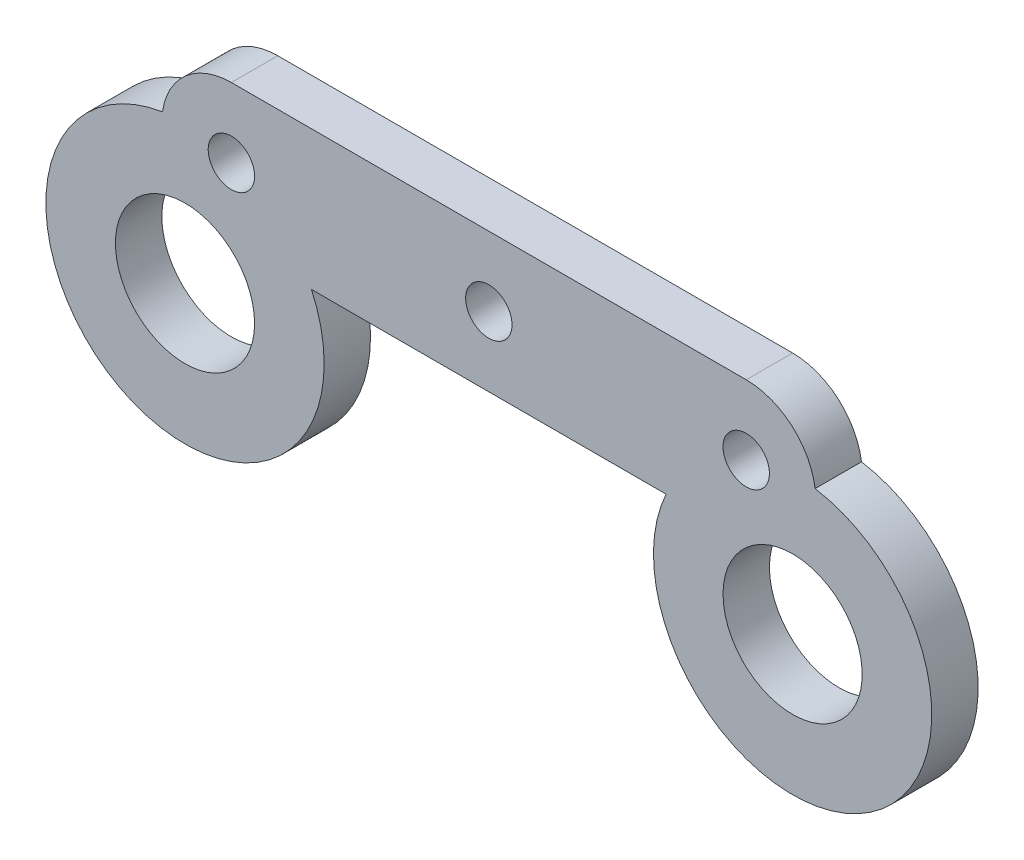
ISO-10303-21;
HEADER;
FILE_DESCRIPTION(('STEP AP214'),'2;1');
FILE_NAME('part.step','',(''),(''),'','','');
FILE_SCHEMA(('AUTOMOTIVE_DESIGN { 1 0 10303 214 1 1 1 1 }'));
ENDSEC;
DATA;
#1=APPLICATION_CONTEXT('core data for automotive mechanical design processes');
#2=APPLICATION_PROTOCOL_DEFINITION('international standard','automotive_design',2000,#1);
#3=PRODUCT_CONTEXT('',#1,'mechanical');
#4=PRODUCT('Part','Part','',(#3));
#5=PRODUCT_RELATED_PRODUCT_CATEGORY('part','',(#4));
#6=PRODUCT_DEFINITION_FORMATION('','',#4);
#7=PRODUCT_DEFINITION_CONTEXT('part definition',#1,'design');
#8=PRODUCT_DEFINITION('design','',#6,#7);
#9=PRODUCT_DEFINITION_SHAPE('','',#8);
#10=(LENGTH_UNIT() NAMED_UNIT(*) SI_UNIT(.MILLI.,.METRE.));
#11=(NAMED_UNIT(*) PLANE_ANGLE_UNIT() SI_UNIT($,.RADIAN.));
#12=(NAMED_UNIT(*) SI_UNIT($,.STERADIAN.) SOLID_ANGLE_UNIT());
#13=UNCERTAINTY_MEASURE_WITH_UNIT(LENGTH_MEASURE(1.E-05),#10,'distance_accuracy_value','');
#14=(GEOMETRIC_REPRESENTATION_CONTEXT(3) GLOBAL_UNCERTAINTY_ASSIGNED_CONTEXT((#13)) GLOBAL_UNIT_ASSIGNED_CONTEXT((#10,
#11,#12)) REPRESENTATION_CONTEXT('',''));
#15=CARTESIAN_POINT('',(0.,0.,0.));
#16=DIRECTION('',(0.,0.,1.));
#17=DIRECTION('',(1.,0.,0.));
#18=AXIS2_PLACEMENT_3D('',#15,#16,#17);
#19=CARTESIAN_POINT('',(11.1001903742504,0.,2.));
#20=DIRECTION('',(0.,0.,1.));
#21=DIRECTION('',(1.,0.,0.));
#22=AXIS2_PLACEMENT_3D('',#19,#20,#21);
#23=PLANE('',#22);
#24=CARTESIAN_POINT('',(-11.1001903742504,0.,2.));
#25=DIRECTION('',(0.,0.,1.));
#26=DIRECTION('',(1.,0.,0.));
#27=AXIS2_PLACEMENT_3D('',#24,#25,#26);
#28=CIRCLE('',#27,0.99999999999969);
#29=CARTESIAN_POINT('',(-10.1001903742507,0.,2.));
#30=VERTEX_POINT('',#29);
#31=EDGE_CURVE('E206',#30,#30,#28,.T.);
#32=ORIENTED_EDGE('',*,*,#31,.F.);
#33=EDGE_LOOP('',(#32));
#34=FACE_BOUND('',#33,.T.);
#35=CARTESIAN_POINT('',(13.1001903742511,-5.49999999999931,2.));
#36=DIRECTION('',(0.,0.,1.));
#37=DIRECTION('',(-1.,0.,0.));
#38=AXIS2_PLACEMENT_3D('',#35,#36,#37);
#39=CIRCLE('',#38,3.);
#40=CARTESIAN_POINT('',(10.1001903742511,-5.49999999999931,2.));
#41=VERTEX_POINT('',#40);
#42=EDGE_CURVE('E218',#41,#41,#39,.T.);
#43=ORIENTED_EDGE('',*,*,#42,.F.);
#44=EDGE_LOOP('',(#43));
#45=FACE_BOUND('',#44,.T.);
#46=CARTESIAN_POINT('',(11.1001903742504,0.,2.));
#47=DIRECTION('',(0.,0.,1.));
#48=DIRECTION('',(1.,0.,0.));
#49=AXIS2_PLACEMENT_3D('',#46,#47,#48);
#50=CIRCLE('',#49,3.);
#51=CARTESIAN_POINT('',(14.0705002353822,0.421021767683334,2.));
#52=VERTEX_POINT('',#51);
#53=CARTESIAN_POINT('',(11.1001903742504,3.,2.));
#54=VERTEX_POINT('',#53);
#55=EDGE_CURVE('E129',#52,#54,#50,.T.);
#56=ORIENTED_EDGE('',*,*,#55,.T.);
#57=DIRECTION('',(-1.,0.,0.));
#58=VECTOR('',#57,1.);
#59=CARTESIAN_POINT('',(-11.1001903742504,3.,2.));
#60=LINE('',#59,#58);
#61=CARTESIAN_POINT('',(-11.1001903742504,3.,2.));
#62=VERTEX_POINT('',#61);
#63=EDGE_CURVE('E87',#54,#62,#60,.T.);
#64=ORIENTED_EDGE('',*,*,#63,.T.);
#65=CARTESIAN_POINT('',(-11.1001903742504,0.,2.));
#66=DIRECTION('',(0.,0.,1.));
#67=DIRECTION('',(1.,0.,0.));
#68=AXIS2_PLACEMENT_3D('',#65,#66,#67);
#69=CIRCLE('',#68,3.);
#70=CARTESIAN_POINT('',(-14.0705002353822,0.421021767683246,2.));
#71=VERTEX_POINT('',#70);
#72=EDGE_CURVE('E100',#62,#71,#69,.T.);
#73=ORIENTED_EDGE('',*,*,#72,.T.);
#74=CARTESIAN_POINT('',(-13.100190374251,-5.49999999999942,2.));
#75=DIRECTION('',(0.,0.,1.));
#76=DIRECTION('',(1.,0.,0.));
#77=AXIS2_PLACEMENT_3D('',#74,#75,#76);
#78=CIRCLE('',#77,5.99999999999837);
#79=CARTESIAN_POINT('',(-7.64583431693467,-3.,2.));
#80=VERTEX_POINT('',#79);
#81=EDGE_CURVE('E94',#71,#80,#78,.T.);
#82=ORIENTED_EDGE('',*,*,#81,.T.);
#83=DIRECTION('',(1.,0.,0.));
#84=VECTOR('',#83,1.);
#85=CARTESIAN_POINT('',(-7.64583431693467,-3.,2.));
#86=LINE('',#85,#84);
#87=CARTESIAN_POINT('',(7.64583431693468,-3.,2.));
#88=VERTEX_POINT('',#87);
#89=EDGE_CURVE('E98',#80,#88,#86,.T.);
#90=ORIENTED_EDGE('',*,*,#89,.T.);
#91=CARTESIAN_POINT('',(13.1001903742511,-5.49999999999931,2.));
#92=DIRECTION('',(0.,0.,1.));
#93=DIRECTION('',(1.,0.,0.));
#94=AXIS2_PLACEMENT_3D('',#91,#92,#93);
#95=CIRCLE('',#94,5.99999999999833);
#96=EDGE_CURVE('E50',#88,#52,#95,.T.);
#97=ORIENTED_EDGE('',*,*,#96,.T.);
#98=EDGE_LOOP('',(#56,#64,#73,#82,#90,#97));
#99=FACE_BOUND('',#98,.T.);
#100=CARTESIAN_POINT('',(0.,0.,2.));
#101=DIRECTION('',(0.,0.,1.));
#102=DIRECTION('',(1.,0.,0.));
#103=AXIS2_PLACEMENT_3D('',#100,#101,#102);
#104=CIRCLE('',#103,1.);
#105=CARTESIAN_POINT('',(1.,0.,2.));
#106=VERTEX_POINT('',#105);
#107=EDGE_CURVE('E122',#106,#106,#104,.T.);
#108=ORIENTED_EDGE('',*,*,#107,.F.);
#109=EDGE_LOOP('',(#108));
#110=FACE_BOUND('',#109,.T.);
#111=CARTESIAN_POINT('',(-13.100190374251,-5.49999999999942,2.));
#112=DIRECTION('',(0.,0.,1.));
#113=DIRECTION('',(1.,0.,0.));
#114=AXIS2_PLACEMENT_3D('',#111,#112,#113);
#115=CIRCLE('',#114,3.);
#116=CARTESIAN_POINT('',(-10.100190374251,-5.49999999999942,2.));
#117=VERTEX_POINT('',#116);
#118=EDGE_CURVE('E212',#117,#117,#115,.T.);
#119=ORIENTED_EDGE('',*,*,#118,.F.);
#120=EDGE_LOOP('',(#119));
#121=FACE_BOUND('',#120,.T.);
#122=CARTESIAN_POINT('',(11.1001903742504,0.,2.));
#123=DIRECTION('',(0.,0.,1.));
#124=DIRECTION('',(-1.,0.,0.));
#125=AXIS2_PLACEMENT_3D('',#122,#123,#124);
#126=CIRCLE('',#125,1.00000000000028);
#127=CARTESIAN_POINT('',(10.1001903742501,0.,2.));
#128=VERTEX_POINT('',#127);
#129=EDGE_CURVE('E198',#128,#128,#126,.T.);
#130=ORIENTED_EDGE('',*,*,#129,.F.);
#131=EDGE_LOOP('',(#130));
#132=FACE_BOUND('',#131,.T.);
#133=ADVANCED_FACE('F33',(#34,#45,#99,#110,#121,#132),#23,.T.);
#134=CARTESIAN_POINT('',(11.1001903742504,0.,0.));
#135=DIRECTION('',(0.,0.,1.));
#136=DIRECTION('',(1.,0.,0.));
#137=AXIS2_PLACEMENT_3D('',#134,#135,#136);
#138=PLANE('',#137);
#139=CARTESIAN_POINT('',(-11.1001903742504,0.,0.));
#140=DIRECTION('',(0.,0.,1.));
#141=DIRECTION('',(1.,0.,0.));
#142=AXIS2_PLACEMENT_3D('',#139,#140,#141);
#143=CIRCLE('',#142,0.99999999999969);
#144=CARTESIAN_POINT('',(-10.1001903742507,0.,0.));
#145=VERTEX_POINT('',#144);
#146=EDGE_CURVE('E204',#145,#145,#143,.T.);
#147=ORIENTED_EDGE('',*,*,#146,.T.);
#148=EDGE_LOOP('',(#147));
#149=FACE_BOUND('',#148,.T.);
#150=CARTESIAN_POINT('',(13.1001903742511,-5.49999999999931,0.));
#151=DIRECTION('',(0.,0.,1.));
#152=DIRECTION('',(-1.,0.,0.));
#153=AXIS2_PLACEMENT_3D('',#150,#151,#152);
#154=CIRCLE('',#153,3.);
#155=CARTESIAN_POINT('',(10.1001903742511,-5.49999999999931,0.));
#156=VERTEX_POINT('',#155);
#157=EDGE_CURVE('E215',#156,#156,#154,.T.);
#158=ORIENTED_EDGE('',*,*,#157,.T.);
#159=EDGE_LOOP('',(#158));
#160=FACE_BOUND('',#159,.T.);
#161=CARTESIAN_POINT('',(11.1001903742504,0.,0.));
#162=DIRECTION('',(0.,0.,1.));
#163=DIRECTION('',(1.,0.,0.));
#164=AXIS2_PLACEMENT_3D('',#161,#162,#163);
#165=CIRCLE('',#164,3.);
#166=CARTESIAN_POINT('',(14.0705002353822,0.421021767683334,0.));
#167=VERTEX_POINT('',#166);
#168=CARTESIAN_POINT('',(11.1001903742504,3.,0.));
#169=VERTEX_POINT('',#168);
#170=EDGE_CURVE('E118',#167,#169,#165,.T.);
#171=ORIENTED_EDGE('',*,*,#170,.F.);
#172=CARTESIAN_POINT('',(13.1001903742511,-5.49999999999931,0.));
#173=DIRECTION('',(0.,0.,1.));
#174=DIRECTION('',(1.,0.,0.));
#175=AXIS2_PLACEMENT_3D('',#172,#173,#174);
#176=CIRCLE('',#175,5.99999999999833);
#177=CARTESIAN_POINT('',(7.64583431693468,-3.,0.));
#178=VERTEX_POINT('',#177);
#179=EDGE_CURVE('E79',#178,#167,#176,.T.);
#180=ORIENTED_EDGE('',*,*,#179,.F.);
#181=DIRECTION('',(1.,0.,0.));
#182=VECTOR('',#181,1.);
#183=CARTESIAN_POINT('',(-7.64583431693467,-3.,0.));
#184=LINE('',#183,#182);
#185=CARTESIAN_POINT('',(-7.64583431693467,-3.,0.));
#186=VERTEX_POINT('',#185);
#187=EDGE_CURVE('E73',#186,#178,#184,.T.);
#188=ORIENTED_EDGE('',*,*,#187,.F.);
#189=CARTESIAN_POINT('',(-13.100190374251,-5.49999999999942,0.));
#190=DIRECTION('',(0.,0.,1.));
#191=DIRECTION('',(1.,0.,0.));
#192=AXIS2_PLACEMENT_3D('',#189,#190,#191);
#193=CIRCLE('',#192,5.99999999999837);
#194=CARTESIAN_POINT('',(-14.0705002353822,0.421021767683246,0.));
#195=VERTEX_POINT('',#194);
#196=EDGE_CURVE('E108',#195,#186,#193,.T.);
#197=ORIENTED_EDGE('',*,*,#196,.F.);
#198=CARTESIAN_POINT('',(-11.1001903742504,0.,0.));
#199=DIRECTION('',(0.,0.,1.));
#200=DIRECTION('',(1.,0.,0.));
#201=AXIS2_PLACEMENT_3D('',#198,#199,#200);
#202=CIRCLE('',#201,3.);
#203=CARTESIAN_POINT('',(-11.1001903742504,3.,0.));
#204=VERTEX_POINT('',#203);
#205=EDGE_CURVE('E124',#204,#195,#202,.T.);
#206=ORIENTED_EDGE('',*,*,#205,.F.);
#207=DIRECTION('',(-1.,0.,0.));
#208=VECTOR('',#207,1.);
#209=CARTESIAN_POINT('',(-11.1001903742504,3.,0.));
#210=LINE('',#209,#208);
#211=EDGE_CURVE('E121',#169,#204,#210,.T.);
#212=ORIENTED_EDGE('',*,*,#211,.F.);
#213=EDGE_LOOP('',(#171,#180,#188,#197,#206,#212));
#214=FACE_BOUND('',#213,.T.);
#215=CARTESIAN_POINT('',(0.,0.,0.));
#216=DIRECTION('',(0.,0.,1.));
#217=DIRECTION('',(1.,0.,0.));
#218=AXIS2_PLACEMENT_3D('',#215,#216,#217);
#219=CIRCLE('',#218,1.);
#220=CARTESIAN_POINT('',(1.,0.,0.));
#221=VERTEX_POINT('',#220);
#222=EDGE_CURVE('E221',#221,#221,#219,.T.);
#223=ORIENTED_EDGE('',*,*,#222,.T.);
#224=EDGE_LOOP('',(#223));
#225=FACE_BOUND('',#224,.T.);
#226=CARTESIAN_POINT('',(-13.100190374251,-5.49999999999942,0.));
#227=DIRECTION('',(0.,0.,1.));
#228=DIRECTION('',(1.,0.,0.));
#229=AXIS2_PLACEMENT_3D('',#226,#227,#228);
#230=CIRCLE('',#229,3.);
#231=CARTESIAN_POINT('',(-10.100190374251,-5.49999999999942,0.));
#232=VERTEX_POINT('',#231);
#233=EDGE_CURVE('E209',#232,#232,#230,.T.);
#234=ORIENTED_EDGE('',*,*,#233,.T.);
#235=EDGE_LOOP('',(#234));
#236=FACE_BOUND('',#235,.T.);
#237=CARTESIAN_POINT('',(11.1001903742504,0.,0.));
#238=DIRECTION('',(0.,0.,1.));
#239=DIRECTION('',(-1.,0.,0.));
#240=AXIS2_PLACEMENT_3D('',#237,#238,#239);
#241=CIRCLE('',#240,1.00000000000028);
#242=CARTESIAN_POINT('',(10.1001903742501,0.,0.));
#243=VERTEX_POINT('',#242);
#244=EDGE_CURVE('E194',#243,#243,#241,.T.);
#245=ORIENTED_EDGE('',*,*,#244,.T.);
#246=EDGE_LOOP('',(#245));
#247=FACE_BOUND('',#246,.T.);
#248=ADVANCED_FACE('F138',(#149,#160,#214,#225,#236,#247),#138,.F.);
#249=CARTESIAN_POINT('',(11.1001903742504,0.,2.));
#250=DIRECTION('',(0.,0.,-1.));
#251=DIRECTION('',(-1.,0.,0.));
#252=AXIS2_PLACEMENT_3D('',#249,#250,#251);
#253=CYLINDRICAL_SURFACE('',#252,3.);
#254=ORIENTED_EDGE('',*,*,#170,.T.);
#255=DIRECTION('',(0.,0.,-1.));
#256=VECTOR('',#255,1.);
#257=CARTESIAN_POINT('',(11.1001903742504,3.,2.));
#258=LINE('',#257,#256);
#259=EDGE_CURVE('E11',#54,#169,#258,.T.);
#260=ORIENTED_EDGE('',*,*,#259,.F.);
#261=ORIENTED_EDGE('',*,*,#55,.F.);
#262=DIRECTION('',(0.,0.,-1.));
#263=VECTOR('',#262,1.);
#264=CARTESIAN_POINT('',(14.0705002353822,0.421021767683334,2.));
#265=LINE('',#264,#263);
#266=EDGE_CURVE('E114',#52,#167,#265,.T.);
#267=ORIENTED_EDGE('',*,*,#266,.T.);
#268=EDGE_LOOP('',(#254,#260,#261,#267));
#269=FACE_BOUND('',#268,.T.);
#270=ADVANCED_FACE('F35',(#269),#253,.T.);
#271=CARTESIAN_POINT('',(-11.1001903742504,3.,2.));
#272=DIRECTION('',(0.,-1.,0.));
#273=DIRECTION('',(0.,0.,-1.));
#274=AXIS2_PLACEMENT_3D('',#271,#272,#273);
#275=PLANE('',#274);
#276=ORIENTED_EDGE('',*,*,#211,.T.);
#277=DIRECTION('',(0.,0.,-1.));
#278=VECTOR('',#277,1.);
#279=CARTESIAN_POINT('',(-11.1001903742504,3.,2.));
#280=LINE('',#279,#278);
#281=EDGE_CURVE('E42',#62,#204,#280,.T.);
#282=ORIENTED_EDGE('',*,*,#281,.F.);
#283=ORIENTED_EDGE('',*,*,#63,.F.);
#284=ORIENTED_EDGE('',*,*,#259,.T.);
#285=EDGE_LOOP('',(#276,#282,#283,#284));
#286=FACE_BOUND('',#285,.T.);
#287=ADVANCED_FACE('F297',(#286),#275,.F.);
#288=CARTESIAN_POINT('',(-11.1001903742504,0.,2.));
#289=DIRECTION('',(0.,0.,-1.));
#290=DIRECTION('',(-1.,0.,0.));
#291=AXIS2_PLACEMENT_3D('',#288,#289,#290);
#292=CYLINDRICAL_SURFACE('',#291,3.);
#293=ORIENTED_EDGE('',*,*,#205,.T.);
#294=DIRECTION('',(0.,0.,-1.));
#295=VECTOR('',#294,1.);
#296=CARTESIAN_POINT('',(-14.0705002353822,0.421021767683246,2.));
#297=LINE('',#296,#295);
#298=EDGE_CURVE('E109',#71,#195,#297,.T.);
#299=ORIENTED_EDGE('',*,*,#298,.F.);
#300=ORIENTED_EDGE('',*,*,#72,.F.);
#301=ORIENTED_EDGE('',*,*,#281,.T.);
#302=EDGE_LOOP('',(#293,#299,#300,#301));
#303=FACE_BOUND('',#302,.T.);
#304=ADVANCED_FACE('F135',(#303),#292,.T.);
#305=CARTESIAN_POINT('',(-13.100190374251,-5.49999999999942,2.));
#306=DIRECTION('',(0.,0.,-1.));
#307=DIRECTION('',(-1.,0.,0.));
#308=AXIS2_PLACEMENT_3D('',#305,#306,#307);
#309=CYLINDRICAL_SURFACE('',#308,5.99999999999837);
#310=ORIENTED_EDGE('',*,*,#196,.T.);
#311=DIRECTION('',(0.,0.,-1.));
#312=VECTOR('',#311,1.);
#313=CARTESIAN_POINT('',(-7.64583431693467,-3.,2.));
#314=LINE('',#313,#312);
#315=EDGE_CURVE('E105',#80,#186,#314,.T.);
#316=ORIENTED_EDGE('',*,*,#315,.F.);
#317=ORIENTED_EDGE('',*,*,#81,.F.);
#318=ORIENTED_EDGE('',*,*,#298,.T.);
#319=EDGE_LOOP('',(#310,#316,#317,#318));
#320=FACE_BOUND('',#319,.T.);
#321=ADVANCED_FACE('F106',(#320),#309,.T.);
#322=CARTESIAN_POINT('',(-7.64583431693467,-3.,2.));
#323=DIRECTION('',(0.,1.,0.));
#324=DIRECTION('',(0.,0.,1.));
#325=AXIS2_PLACEMENT_3D('',#322,#323,#324);
#326=PLANE('',#325);
#327=CARTESIAN_POINT('',(0.,-3.,1.));
#328=DIRECTION('',(0.,-1.,0.));
#329=DIRECTION('',(0.,0.,-1.));
#330=AXIS2_PLACEMENT_3D('',#327,#328,#329);
#331=CIRCLE('',#330,0.5);
#332=CARTESIAN_POINT('',(0.,-3.,0.5));
#333=VERTEX_POINT('',#332);
#334=EDGE_CURVE('E195',#333,#333,#331,.T.);
#335=ORIENTED_EDGE('',*,*,#334,.F.);
#336=EDGE_LOOP('',(#335));
#337=FACE_BOUND('',#336,.T.);
#338=ORIENTED_EDGE('',*,*,#187,.T.);
#339=DIRECTION('',(0.,0.,-1.));
#340=VECTOR('',#339,1.);
#341=CARTESIAN_POINT('',(7.64583431693468,-3.,2.));
#342=LINE('',#341,#340);
#343=EDGE_CURVE('E110',#88,#178,#342,.T.);
#344=ORIENTED_EDGE('',*,*,#343,.F.);
#345=ORIENTED_EDGE('',*,*,#89,.F.);
#346=ORIENTED_EDGE('',*,*,#315,.T.);
#347=EDGE_LOOP('',(#338,#344,#345,#346));
#348=FACE_BOUND('',#347,.T.);
#349=ADVANCED_FACE('F112',(#337,#348),#326,.F.);
#350=CARTESIAN_POINT('',(13.1001903742511,-5.49999999999931,2.));
#351=DIRECTION('',(0.,0.,-1.));
#352=DIRECTION('',(-1.,0.,0.));
#353=AXIS2_PLACEMENT_3D('',#350,#351,#352);
#354=CYLINDRICAL_SURFACE('',#353,5.99999999999833);
#355=ORIENTED_EDGE('',*,*,#179,.T.);
#356=ORIENTED_EDGE('',*,*,#266,.F.);
#357=ORIENTED_EDGE('',*,*,#96,.F.);
#358=ORIENTED_EDGE('',*,*,#343,.T.);
#359=EDGE_LOOP('',(#355,#356,#357,#358));
#360=FACE_BOUND('',#359,.T.);
#361=ADVANCED_FACE('F143',(#360),#354,.T.);
#362=CARTESIAN_POINT('',(0.,0.,2.));
#363=DIRECTION('',(0.,0.,-1.));
#364=DIRECTION('',(-1.,0.,0.));
#365=AXIS2_PLACEMENT_3D('',#362,#363,#364);
#366=CYLINDRICAL_SURFACE('',#365,1.);
#367=ORIENTED_EDGE('',*,*,#107,.T.);
#368=EDGE_LOOP('',(#367));
#369=FACE_BOUND('',#368,.T.);
#370=ORIENTED_EDGE('',*,*,#222,.F.);
#371=EDGE_LOOP('',(#370));
#372=FACE_BOUND('',#371,.T.);
#373=ADVANCED_FACE('F145',(#369,#372),#366,.F.);
#374=CARTESIAN_POINT('',(13.1001903742511,-5.49999999999931,2.));
#375=DIRECTION('',(0.,0.,-1.));
#376=DIRECTION('',(-1.,0.,0.));
#377=AXIS2_PLACEMENT_3D('',#374,#375,#376);
#378=CYLINDRICAL_SURFACE('',#377,3.);
#379=ORIENTED_EDGE('',*,*,#42,.T.);
#380=EDGE_LOOP('',(#379));
#381=FACE_BOUND('',#380,.T.);
#382=ORIENTED_EDGE('',*,*,#157,.F.);
#383=EDGE_LOOP('',(#382));
#384=FACE_BOUND('',#383,.T.);
#385=ADVANCED_FACE('F151',(#381,#384),#378,.F.);
#386=CARTESIAN_POINT('',(-13.100190374251,-5.49999999999942,2.));
#387=DIRECTION('',(0.,0.,-1.));
#388=DIRECTION('',(-1.,0.,0.));
#389=AXIS2_PLACEMENT_3D('',#386,#387,#388);
#390=CYLINDRICAL_SURFACE('',#389,3.);
#391=ORIENTED_EDGE('',*,*,#118,.T.);
#392=EDGE_LOOP('',(#391));
#393=FACE_BOUND('',#392,.T.);
#394=ORIENTED_EDGE('',*,*,#233,.F.);
#395=EDGE_LOOP('',(#394));
#396=FACE_BOUND('',#395,.T.);
#397=ADVANCED_FACE('F169',(#393,#396),#390,.F.);
#398=CARTESIAN_POINT('',(-11.1001903742504,0.,2.));
#399=DIRECTION('',(0.,0.,-1.));
#400=DIRECTION('',(-1.,0.,0.));
#401=AXIS2_PLACEMENT_3D('',#398,#399,#400);
#402=CYLINDRICAL_SURFACE('',#401,0.99999999999969);
#403=ORIENTED_EDGE('',*,*,#31,.T.);
#404=EDGE_LOOP('',(#403));
#405=FACE_BOUND('',#404,.T.);
#406=ORIENTED_EDGE('',*,*,#146,.F.);
#407=EDGE_LOOP('',(#406));
#408=FACE_BOUND('',#407,.T.);
#409=ADVANCED_FACE('F173',(#405,#408),#402,.F.);
#410=CARTESIAN_POINT('',(11.1001903742504,0.,2.));
#411=DIRECTION('',(0.,0.,-1.));
#412=DIRECTION('',(-1.,0.,0.));
#413=AXIS2_PLACEMENT_3D('',#410,#411,#412);
#414=CYLINDRICAL_SURFACE('',#413,1.00000000000028);
#415=ORIENTED_EDGE('',*,*,#129,.T.);
#416=EDGE_LOOP('',(#415));
#417=FACE_BOUND('',#416,.T.);
#418=ORIENTED_EDGE('',*,*,#244,.F.);
#419=EDGE_LOOP('',(#418));
#420=FACE_BOUND('',#419,.T.);
#421=ADVANCED_FACE('F177',(#417,#420),#414,.F.);
#422=CARTESIAN_POINT('',(0.,-2.5,1.));
#423=DIRECTION('',(0.,-1.,0.));
#424=DIRECTION('',(0.,0.,-1.));
#425=AXIS2_PLACEMENT_3D('',#422,#423,#424);
#426=CYLINDRICAL_SURFACE('',#425,0.5);
#427=CARTESIAN_POINT('',(0.,-2.5,1.));
#428=DIRECTION('',(0.,-1.,0.));
#429=DIRECTION('',(0.,0.,-1.));
#430=AXIS2_PLACEMENT_3D('',#427,#428,#429);
#431=CIRCLE('',#430,0.5);
#432=CARTESIAN_POINT('',(0.,-2.5,0.5));
#433=VERTEX_POINT('',#432);
#434=EDGE_CURVE('E193',#433,#433,#431,.T.);
#435=ORIENTED_EDGE('',*,*,#434,.F.);
#436=EDGE_LOOP('',(#435));
#437=FACE_BOUND('',#436,.T.);
#438=ORIENTED_EDGE('',*,*,#334,.T.);
#439=EDGE_LOOP('',(#438));
#440=FACE_BOUND('',#439,.T.);
#441=ADVANCED_FACE('F181',(#437,#440),#426,.F.);
#442=CARTESIAN_POINT('',(0.,-2.5,1.));
#443=DIRECTION('',(0.,-1.,0.));
#444=DIRECTION('',(0.,0.,-1.));
#445=AXIS2_PLACEMENT_3D('',#442,#443,#444);
#446=PLANE('',#445);
#447=ORIENTED_EDGE('',*,*,#434,.T.);
#448=EDGE_LOOP('',(#447));
#449=FACE_BOUND('',#448,.T.);
#450=ADVANCED_FACE('F185',(#449),#446,.T.);
#451=CLOSED_SHELL('',(#133,#248,#270,#287,#304,#321,#349,#361,#373,#385,#397,#409,#421,#441,#450));
#452=MANIFOLD_SOLID_BREP('B2',#451);
#453=ADVANCED_BREP_SHAPE_REPRESENTATION('',(#18,#452),#14);
#454=SHAPE_DEFINITION_REPRESENTATION(#9,#453);
ENDSEC;
END-ISO-10303-21;
